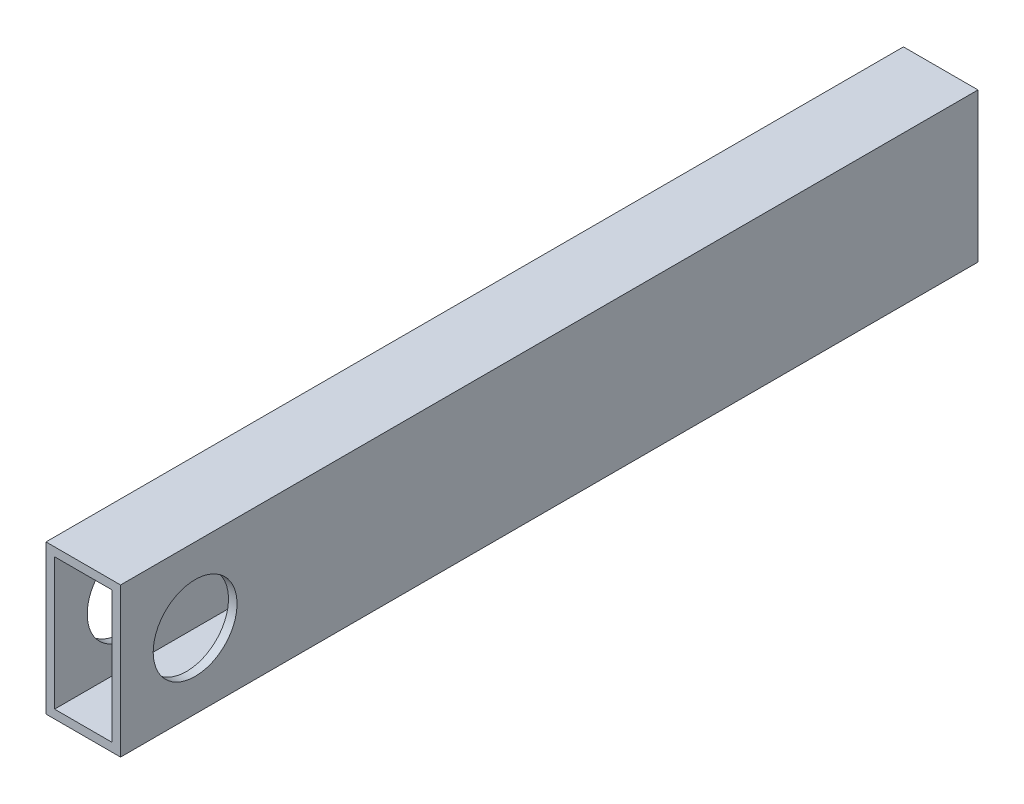
ISO-10303-21;
HEADER;
FILE_DESCRIPTION(('STEP AP214'),'2;1');
FILE_NAME('part.step','',(''),(''),'','','');
FILE_SCHEMA(('AUTOMOTIVE_DESIGN { 1 0 10303 214 1 1 1 1 }'));
ENDSEC;
DATA;
#1=APPLICATION_CONTEXT('core data for automotive mechanical design processes');
#2=APPLICATION_PROTOCOL_DEFINITION('international standard','automotive_design',2000,#1);
#3=PRODUCT_CONTEXT('',#1,'mechanical');
#4=PRODUCT('Part','Part','',(#3));
#5=PRODUCT_RELATED_PRODUCT_CATEGORY('part','',(#4));
#6=PRODUCT_DEFINITION_FORMATION('','',#4);
#7=PRODUCT_DEFINITION_CONTEXT('part definition',#1,'design');
#8=PRODUCT_DEFINITION('design','',#6,#7);
#9=PRODUCT_DEFINITION_SHAPE('','',#8);
#10=(LENGTH_UNIT() NAMED_UNIT(*) SI_UNIT(.MILLI.,.METRE.));
#11=(NAMED_UNIT(*) PLANE_ANGLE_UNIT() SI_UNIT($,.RADIAN.));
#12=(NAMED_UNIT(*) SI_UNIT($,.STERADIAN.) SOLID_ANGLE_UNIT());
#13=UNCERTAINTY_MEASURE_WITH_UNIT(LENGTH_MEASURE(1.E-05),#10,'distance_accuracy_value','');
#14=(GEOMETRIC_REPRESENTATION_CONTEXT(3) GLOBAL_UNCERTAINTY_ASSIGNED_CONTEXT((#13)) GLOBAL_UNIT_ASSIGNED_CONTEXT((#10,
#11,#12)) REPRESENTATION_CONTEXT('',''));
#15=CARTESIAN_POINT('',(0.,0.,0.));
#16=DIRECTION('',(0.,0.,1.));
#17=DIRECTION('',(1.,0.,0.));
#18=AXIS2_PLACEMENT_3D('',#15,#16,#17);
#19=CARTESIAN_POINT('',(0.,0.,292.1));
#20=DIRECTION('',(0.,0.,-1.));
#21=DIRECTION('',(-1.,0.,0.));
#22=AXIS2_PLACEMENT_3D('',#19,#20,#21);
#23=PLANE('',#22);
#24=DIRECTION('',(0.,1.,0.));
#25=VECTOR('',#24,1.);
#26=CARTESIAN_POINT('',(12.7,-25.4,292.1));
#27=LINE('',#26,#25);
#28=CARTESIAN_POINT('',(12.7,-25.4,292.1));
#29=VERTEX_POINT('',#28);
#30=CARTESIAN_POINT('',(12.7,25.4,292.1));
#31=VERTEX_POINT('',#30);
#32=EDGE_CURVE('E166',#29,#31,#27,.T.);
#33=ORIENTED_EDGE('',*,*,#32,.T.);
#34=DIRECTION('',(-1.,0.,0.));
#35=VECTOR('',#34,1.);
#36=CARTESIAN_POINT('',(-12.7,25.4,292.1));
#37=LINE('',#36,#35);
#38=CARTESIAN_POINT('',(-12.7,25.4,292.1));
#39=VERTEX_POINT('',#38);
#40=EDGE_CURVE('E170',#31,#39,#37,.T.);
#41=ORIENTED_EDGE('',*,*,#40,.T.);
#42=DIRECTION('',(0.,-1.,0.));
#43=VECTOR('',#42,1.);
#44=CARTESIAN_POINT('',(-12.7,-25.4,292.1));
#45=LINE('',#44,#43);
#46=CARTESIAN_POINT('',(-12.7,-25.4,292.1));
#47=VERTEX_POINT('',#46);
#48=EDGE_CURVE('E174',#39,#47,#45,.T.);
#49=ORIENTED_EDGE('',*,*,#48,.T.);
#50=DIRECTION('',(1.,0.,0.));
#51=VECTOR('',#50,1.);
#52=CARTESIAN_POINT('',(-12.7,-25.4,292.1));
#53=LINE('',#52,#51);
#54=EDGE_CURVE('E177',#47,#29,#53,.T.);
#55=ORIENTED_EDGE('',*,*,#54,.T.);
#56=EDGE_LOOP('',(#33,#41,#49,#55));
#57=FACE_BOUND('',#56,.T.);
#58=DIRECTION('',(0.,-1.,0.));
#59=VECTOR('',#58,1.);
#60=CARTESIAN_POINT('',(-9.779,-22.479,292.1));
#61=LINE('',#60,#59);
#62=CARTESIAN_POINT('',(-9.779,22.479,292.1));
#63=VERTEX_POINT('',#62);
#64=CARTESIAN_POINT('',(-9.779,-22.479,292.1));
#65=VERTEX_POINT('',#64);
#66=EDGE_CURVE('E116',#63,#65,#61,.T.);
#67=ORIENTED_EDGE('',*,*,#66,.F.);
#68=DIRECTION('',(-1.,0.,0.));
#69=VECTOR('',#68,1.);
#70=CARTESIAN_POINT('',(-9.779,22.479,292.1));
#71=LINE('',#70,#69);
#72=CARTESIAN_POINT('',(9.779,22.479,292.1));
#73=VERTEX_POINT('',#72);
#74=EDGE_CURVE('E142',#73,#63,#71,.T.);
#75=ORIENTED_EDGE('',*,*,#74,.F.);
#76=DIRECTION('',(0.,1.,0.));
#77=VECTOR('',#76,1.);
#78=CARTESIAN_POINT('',(9.779,-22.479,292.1));
#79=LINE('',#78,#77);
#80=CARTESIAN_POINT('',(9.779,-22.479,292.1));
#81=VERTEX_POINT('',#80);
#82=EDGE_CURVE('E138',#81,#73,#79,.T.);
#83=ORIENTED_EDGE('',*,*,#82,.F.);
#84=DIRECTION('',(1.,0.,0.));
#85=VECTOR('',#84,1.);
#86=CARTESIAN_POINT('',(-9.779,-22.479,292.1));
#87=LINE('',#86,#85);
#88=EDGE_CURVE('E125',#65,#81,#87,.T.);
#89=ORIENTED_EDGE('',*,*,#88,.F.);
#90=EDGE_LOOP('',(#67,#75,#83,#89));
#91=FACE_BOUND('',#90,.T.);
#92=ADVANCED_FACE('F49',(#57,#91),#23,.F.);
#93=CARTESIAN_POINT('',(0.,0.,0.));
#94=DIRECTION('',(0.,0.,-1.));
#95=DIRECTION('',(-1.,0.,0.));
#96=AXIS2_PLACEMENT_3D('',#93,#94,#95);
#97=PLANE('',#96);
#98=DIRECTION('',(0.,1.,0.));
#99=VECTOR('',#98,1.);
#100=CARTESIAN_POINT('',(12.7,-25.4,0.));
#101=LINE('',#100,#99);
#102=CARTESIAN_POINT('',(12.7,-25.4,0.));
#103=VERTEX_POINT('',#102);
#104=CARTESIAN_POINT('',(12.7,25.4,0.));
#105=VERTEX_POINT('',#104);
#106=EDGE_CURVE('E134',#103,#105,#101,.T.);
#107=ORIENTED_EDGE('',*,*,#106,.F.);
#108=DIRECTION('',(1.,0.,0.));
#109=VECTOR('',#108,1.);
#110=CARTESIAN_POINT('',(-12.7,-25.4,0.));
#111=LINE('',#110,#109);
#112=CARTESIAN_POINT('',(-12.7,-25.4,0.));
#113=VERTEX_POINT('',#112);
#114=EDGE_CURVE('E171',#113,#103,#111,.T.);
#115=ORIENTED_EDGE('',*,*,#114,.F.);
#116=DIRECTION('',(0.,-1.,0.));
#117=VECTOR('',#116,1.);
#118=CARTESIAN_POINT('',(-12.7,-25.4,0.));
#119=LINE('',#118,#117);
#120=CARTESIAN_POINT('',(-12.7,25.4,0.));
#121=VERTEX_POINT('',#120);
#122=EDGE_CURVE('E187',#121,#113,#119,.T.);
#123=ORIENTED_EDGE('',*,*,#122,.F.);
#124=DIRECTION('',(-1.,0.,0.));
#125=VECTOR('',#124,1.);
#126=CARTESIAN_POINT('',(-12.7,25.4,0.));
#127=LINE('',#126,#125);
#128=EDGE_CURVE('E184',#105,#121,#127,.T.);
#129=ORIENTED_EDGE('',*,*,#128,.F.);
#130=EDGE_LOOP('',(#107,#115,#123,#129));
#131=FACE_BOUND('',#130,.T.);
#132=DIRECTION('',(-1.,0.,0.));
#133=VECTOR('',#132,1.);
#134=CARTESIAN_POINT('',(-9.779,22.479,0.));
#135=LINE('',#134,#133);
#136=CARTESIAN_POINT('',(9.779,22.479,0.));
#137=VERTEX_POINT('',#136);
#138=CARTESIAN_POINT('',(-9.779,22.479,0.));
#139=VERTEX_POINT('',#138);
#140=EDGE_CURVE('E126',#137,#139,#135,.T.);
#141=ORIENTED_EDGE('',*,*,#140,.T.);
#142=DIRECTION('',(0.,-1.,0.));
#143=VECTOR('',#142,1.);
#144=CARTESIAN_POINT('',(-9.779,-22.479,0.));
#145=LINE('',#144,#143);
#146=CARTESIAN_POINT('',(-9.779,-22.479,0.));
#147=VERTEX_POINT('',#146);
#148=EDGE_CURVE('E74',#139,#147,#145,.T.);
#149=ORIENTED_EDGE('',*,*,#148,.T.);
#150=DIRECTION('',(1.,0.,0.));
#151=VECTOR('',#150,1.);
#152=CARTESIAN_POINT('',(-9.779,-22.479,0.));
#153=LINE('',#152,#151);
#154=CARTESIAN_POINT('',(9.779,-22.479,0.));
#155=VERTEX_POINT('',#154);
#156=EDGE_CURVE('E132',#147,#155,#153,.T.);
#157=ORIENTED_EDGE('',*,*,#156,.T.);
#158=DIRECTION('',(0.,1.,0.));
#159=VECTOR('',#158,1.);
#160=CARTESIAN_POINT('',(9.779,-22.479,0.));
#161=LINE('',#160,#159);
#162=EDGE_CURVE('E153',#155,#137,#161,.T.);
#163=ORIENTED_EDGE('',*,*,#162,.T.);
#164=EDGE_LOOP('',(#141,#149,#157,#163));
#165=FACE_BOUND('',#164,.T.);
#166=ADVANCED_FACE('F211',(#131,#165),#97,.T.);
#167=CARTESIAN_POINT('',(12.7,-25.4,292.1));
#168=DIRECTION('',(-1.,0.,0.));
#169=DIRECTION('',(0.,0.,1.));
#170=AXIS2_PLACEMENT_3D('',#167,#168,#169);
#171=PLANE('',#170);
#172=CARTESIAN_POINT('',(12.7,0.,266.7));
#173=DIRECTION('',(-1.,0.,0.));
#174=DIRECTION('',(0.,0.,1.));
#175=AXIS2_PLACEMENT_3D('',#172,#173,#174);
#176=CIRCLE('',#175,14.2875);
#177=CARTESIAN_POINT('',(12.7,0.,280.9875));
#178=VERTEX_POINT('',#177);
#179=EDGE_CURVE('E150',#178,#178,#176,.T.);
#180=ORIENTED_EDGE('',*,*,#179,.T.);
#181=EDGE_LOOP('',(#180));
#182=FACE_BOUND('',#181,.T.);
#183=ORIENTED_EDGE('',*,*,#106,.T.);
#184=DIRECTION('',(0.,0.,-1.));
#185=VECTOR('',#184,1.);
#186=CARTESIAN_POINT('',(12.7,25.4,292.1));
#187=LINE('',#186,#185);
#188=EDGE_CURVE('E11',#31,#105,#187,.T.);
#189=ORIENTED_EDGE('',*,*,#188,.F.);
#190=ORIENTED_EDGE('',*,*,#32,.F.);
#191=DIRECTION('',(0.,0.,-1.));
#192=VECTOR('',#191,1.);
#193=CARTESIAN_POINT('',(12.7,-25.4,292.1));
#194=LINE('',#193,#192);
#195=EDGE_CURVE('E180',#29,#103,#194,.T.);
#196=ORIENTED_EDGE('',*,*,#195,.T.);
#197=EDGE_LOOP('',(#183,#189,#190,#196));
#198=FACE_BOUND('',#197,.T.);
#199=ADVANCED_FACE('F51',(#182,#198),#171,.F.);
#200=CARTESIAN_POINT('',(-12.7,25.4,292.1));
#201=DIRECTION('',(0.,-1.,0.));
#202=DIRECTION('',(0.,0.,-1.));
#203=AXIS2_PLACEMENT_3D('',#200,#201,#202);
#204=PLANE('',#203);
#205=ORIENTED_EDGE('',*,*,#128,.T.);
#206=DIRECTION('',(0.,0.,-1.));
#207=VECTOR('',#206,1.);
#208=CARTESIAN_POINT('',(-12.7,25.4,292.1));
#209=LINE('',#208,#207);
#210=EDGE_CURVE('E59',#39,#121,#209,.T.);
#211=ORIENTED_EDGE('',*,*,#210,.F.);
#212=ORIENTED_EDGE('',*,*,#40,.F.);
#213=ORIENTED_EDGE('',*,*,#188,.T.);
#214=EDGE_LOOP('',(#205,#211,#212,#213));
#215=FACE_BOUND('',#214,.T.);
#216=ADVANCED_FACE('F221',(#215),#204,.F.);
#217=CARTESIAN_POINT('',(-12.7,-25.4,292.1));
#218=DIRECTION('',(1.,0.,0.));
#219=DIRECTION('',(0.,0.,-1.));
#220=AXIS2_PLACEMENT_3D('',#217,#218,#219);
#221=PLANE('',#220);
#222=CARTESIAN_POINT('',(-12.7,0.,266.7));
#223=DIRECTION('',(1.,0.,0.));
#224=DIRECTION('',(0.,0.,-1.));
#225=AXIS2_PLACEMENT_3D('',#222,#223,#224);
#226=CIRCLE('',#225,14.2875);
#227=CARTESIAN_POINT('',(-12.7,0.,252.4125));
#228=VERTEX_POINT('',#227);
#229=EDGE_CURVE('E264',#228,#228,#226,.T.);
#230=ORIENTED_EDGE('',*,*,#229,.T.);
#231=EDGE_LOOP('',(#230));
#232=FACE_BOUND('',#231,.T.);
#233=ORIENTED_EDGE('',*,*,#122,.T.);
#234=DIRECTION('',(0.,0.,-1.));
#235=VECTOR('',#234,1.);
#236=CARTESIAN_POINT('',(-12.7,-25.4,292.1));
#237=LINE('',#236,#235);
#238=EDGE_CURVE('E195',#47,#113,#237,.T.);
#239=ORIENTED_EDGE('',*,*,#238,.F.);
#240=ORIENTED_EDGE('',*,*,#48,.F.);
#241=ORIENTED_EDGE('',*,*,#210,.T.);
#242=EDGE_LOOP('',(#233,#239,#240,#241));
#243=FACE_BOUND('',#242,.T.);
#244=ADVANCED_FACE('F205',(#232,#243),#221,.F.);
#245=CARTESIAN_POINT('',(-12.7,-25.4,292.1));
#246=DIRECTION('',(0.,1.,0.));
#247=DIRECTION('',(0.,0.,1.));
#248=AXIS2_PLACEMENT_3D('',#245,#246,#247);
#249=PLANE('',#248);
#250=ORIENTED_EDGE('',*,*,#114,.T.);
#251=ORIENTED_EDGE('',*,*,#195,.F.);
#252=ORIENTED_EDGE('',*,*,#54,.F.);
#253=ORIENTED_EDGE('',*,*,#238,.T.);
#254=EDGE_LOOP('',(#250,#251,#252,#253));
#255=FACE_BOUND('',#254,.T.);
#256=ADVANCED_FACE('F215',(#255),#249,.F.);
#257=CARTESIAN_POINT('',(-9.779,-22.479,292.1));
#258=DIRECTION('',(1.,0.,0.));
#259=DIRECTION('',(0.,0.,-1.));
#260=AXIS2_PLACEMENT_3D('',#257,#258,#259);
#261=PLANE('',#260);
#262=CARTESIAN_POINT('',(-9.779,0.,266.7));
#263=DIRECTION('',(1.,0.,0.));
#264=DIRECTION('',(0.,0.,-1.));
#265=AXIS2_PLACEMENT_3D('',#262,#263,#264);
#266=CIRCLE('',#265,14.2875);
#267=CARTESIAN_POINT('',(-9.779,0.,252.4125));
#268=VERTEX_POINT('',#267);
#269=EDGE_CURVE('E256',#268,#268,#266,.T.);
#270=ORIENTED_EDGE('',*,*,#269,.F.);
#271=EDGE_LOOP('',(#270));
#272=FACE_BOUND('',#271,.T.);
#273=ORIENTED_EDGE('',*,*,#148,.F.);
#274=DIRECTION('',(0.,0.,-1.));
#275=VECTOR('',#274,1.);
#276=CARTESIAN_POINT('',(-9.779,22.479,292.1));
#277=LINE('',#276,#275);
#278=EDGE_CURVE('E120',#63,#139,#277,.T.);
#279=ORIENTED_EDGE('',*,*,#278,.F.);
#280=ORIENTED_EDGE('',*,*,#66,.T.);
#281=DIRECTION('',(0.,0.,-1.));
#282=VECTOR('',#281,1.);
#283=CARTESIAN_POINT('',(-9.779,-22.479,292.1));
#284=LINE('',#283,#282);
#285=EDGE_CURVE('E119',#65,#147,#284,.T.);
#286=ORIENTED_EDGE('',*,*,#285,.T.);
#287=EDGE_LOOP('',(#273,#279,#280,#286));
#288=FACE_BOUND('',#287,.T.);
#289=ADVANCED_FACE('F118',(#272,#288),#261,.T.);
#290=CARTESIAN_POINT('',(-9.779,-22.479,292.1));
#291=DIRECTION('',(0.,1.,0.));
#292=DIRECTION('',(0.,0.,1.));
#293=AXIS2_PLACEMENT_3D('',#290,#291,#292);
#294=PLANE('',#293);
#295=ORIENTED_EDGE('',*,*,#156,.F.);
#296=ORIENTED_EDGE('',*,*,#285,.F.);
#297=ORIENTED_EDGE('',*,*,#88,.T.);
#298=DIRECTION('',(0.,0.,-1.));
#299=VECTOR('',#298,1.);
#300=CARTESIAN_POINT('',(9.779,-22.479,292.1));
#301=LINE('',#300,#299);
#302=EDGE_CURVE('E135',#81,#155,#301,.T.);
#303=ORIENTED_EDGE('',*,*,#302,.T.);
#304=EDGE_LOOP('',(#295,#296,#297,#303));
#305=FACE_BOUND('',#304,.T.);
#306=ADVANCED_FACE('F129',(#305),#294,.T.);
#307=CARTESIAN_POINT('',(9.779,-22.479,292.1));
#308=DIRECTION('',(-1.,0.,0.));
#309=DIRECTION('',(0.,0.,1.));
#310=AXIS2_PLACEMENT_3D('',#307,#308,#309);
#311=PLANE('',#310);
#312=CARTESIAN_POINT('',(9.779,0.,266.7));
#313=DIRECTION('',(-1.,0.,0.));
#314=DIRECTION('',(0.,0.,1.));
#315=AXIS2_PLACEMENT_3D('',#312,#313,#314);
#316=CIRCLE('',#315,14.2875);
#317=CARTESIAN_POINT('',(9.779,0.,280.9875));
#318=VERTEX_POINT('',#317);
#319=EDGE_CURVE('E53',#318,#318,#316,.T.);
#320=ORIENTED_EDGE('',*,*,#319,.F.);
#321=EDGE_LOOP('',(#320));
#322=FACE_BOUND('',#321,.T.);
#323=ORIENTED_EDGE('',*,*,#162,.F.);
#324=ORIENTED_EDGE('',*,*,#302,.F.);
#325=ORIENTED_EDGE('',*,*,#82,.T.);
#326=DIRECTION('',(0.,0.,-1.));
#327=VECTOR('',#326,1.);
#328=CARTESIAN_POINT('',(9.779,22.479,292.1));
#329=LINE('',#328,#327);
#330=EDGE_CURVE('E66',#73,#137,#329,.T.);
#331=ORIENTED_EDGE('',*,*,#330,.T.);
#332=EDGE_LOOP('',(#323,#324,#325,#331));
#333=FACE_BOUND('',#332,.T.);
#334=ADVANCED_FACE('F253',(#322,#333),#311,.T.);
#335=CARTESIAN_POINT('',(-9.779,22.479,292.1));
#336=DIRECTION('',(0.,-1.,0.));
#337=DIRECTION('',(0.,0.,-1.));
#338=AXIS2_PLACEMENT_3D('',#335,#336,#337);
#339=PLANE('',#338);
#340=ORIENTED_EDGE('',*,*,#140,.F.);
#341=ORIENTED_EDGE('',*,*,#330,.F.);
#342=ORIENTED_EDGE('',*,*,#74,.T.);
#343=ORIENTED_EDGE('',*,*,#278,.T.);
#344=EDGE_LOOP('',(#340,#341,#342,#343));
#345=FACE_BOUND('',#344,.T.);
#346=ADVANCED_FACE('F277',(#345),#339,.T.);
#347=CARTESIAN_POINT('',(-12.7,0.,266.7));
#348=DIRECTION('',(1.,0.,0.));
#349=DIRECTION('',(0.,0.,-1.));
#350=AXIS2_PLACEMENT_3D('',#347,#348,#349);
#351=CYLINDRICAL_SURFACE('',#350,14.2875);
#352=ORIENTED_EDGE('',*,*,#319,.T.);
#353=EDGE_LOOP('',(#352));
#354=FACE_BOUND('',#353,.T.);
#355=ORIENTED_EDGE('',*,*,#179,.F.);
#356=EDGE_LOOP('',(#355));
#357=FACE_BOUND('',#356,.T.);
#358=ADVANCED_FACE('F272',(#354,#357),#351,.F.);
#359=ORIENTED_EDGE('',*,*,#269,.T.);
#360=EDGE_LOOP('',(#359));
#361=FACE_BOUND('',#360,.T.);
#362=ORIENTED_EDGE('',*,*,#229,.F.);
#363=EDGE_LOOP('',(#362));
#364=FACE_BOUND('',#363,.T.);
#365=ADVANCED_FACE('F270',(#361,#364),#351,.F.);
#366=CLOSED_SHELL('',(#92,#166,#199,#216,#244,#256,#289,#306,#334,#346,#358,#365));
#367=MANIFOLD_SOLID_BREP('B2',#366);
#368=ADVANCED_BREP_SHAPE_REPRESENTATION('',(#18,#367),#14);
#369=SHAPE_DEFINITION_REPRESENTATION(#9,#368);
ENDSEC;
END-ISO-10303-21;
